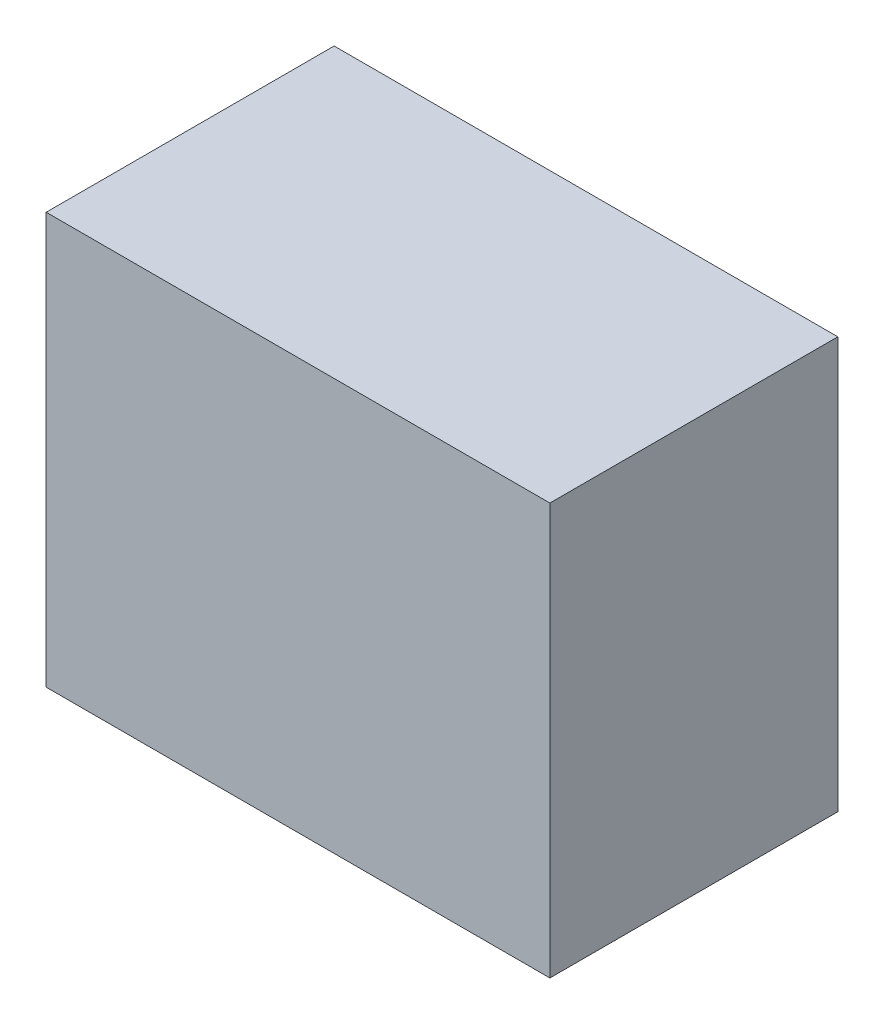
ISO-10303-21;
HEADER;
FILE_DESCRIPTION(('STEP AP214'),'2;1');
FILE_NAME('part.step','',(''),(''),'','','');
FILE_SCHEMA(('AUTOMOTIVE_DESIGN { 1 0 10303 214 1 1 1 1 }'));
ENDSEC;
DATA;
#1=APPLICATION_CONTEXT('core data for automotive mechanical design processes');
#2=APPLICATION_PROTOCOL_DEFINITION('international standard','automotive_design',2000,#1);
#3=PRODUCT_CONTEXT('',#1,'mechanical');
#4=PRODUCT('Part','Part','',(#3));
#5=PRODUCT_RELATED_PRODUCT_CATEGORY('part','',(#4));
#6=PRODUCT_DEFINITION_FORMATION('','',#4);
#7=PRODUCT_DEFINITION_CONTEXT('part definition',#1,'design');
#8=PRODUCT_DEFINITION('design','',#6,#7);
#9=PRODUCT_DEFINITION_SHAPE('','',#8);
#10=(LENGTH_UNIT() NAMED_UNIT(*) SI_UNIT(.MILLI.,.METRE.));
#11=(NAMED_UNIT(*) PLANE_ANGLE_UNIT() SI_UNIT($,.RADIAN.));
#12=(NAMED_UNIT(*) SI_UNIT($,.STERADIAN.) SOLID_ANGLE_UNIT());
#13=UNCERTAINTY_MEASURE_WITH_UNIT(LENGTH_MEASURE(1.E-05),#10,'distance_accuracy_value','');
#14=(GEOMETRIC_REPRESENTATION_CONTEXT(3) GLOBAL_UNCERTAINTY_ASSIGNED_CONTEXT((#13)) GLOBAL_UNIT_ASSIGNED_CONTEXT((#10,
#11,#12)) REPRESENTATION_CONTEXT('',''));
#15=CARTESIAN_POINT('',(0.,0.,0.));
#16=DIRECTION('',(0.,0.,1.));
#17=DIRECTION('',(1.,0.,0.));
#18=AXIS2_PLACEMENT_3D('',#15,#16,#17);
#19=CARTESIAN_POINT('',(0.,0.,0.));
#20=DIRECTION('',(1.,0.,0.));
#21=DIRECTION('',(0.,0.,1.));
#22=AXIS2_PLACEMENT_3D('',#19,#20,#21);
#23=PLANE('',#22);
#24=DIRECTION('',(0.,1.,0.));
#25=VECTOR('',#24,1.);
#26=CARTESIAN_POINT('',(0.,0.,0.343));
#27=LINE('',#26,#25);
#28=CARTESIAN_POINT('',(0.,0.,0.343));
#29=VERTEX_POINT('',#28);
#30=CARTESIAN_POINT('',(0.,0.49,0.343));
#31=VERTEX_POINT('',#30);
#32=EDGE_CURVE('E11',#29,#31,#27,.T.);
#33=ORIENTED_EDGE('',*,*,#32,.T.);
#34=DIRECTION('',(0.,0.,1.));
#35=VECTOR('',#34,1.);
#36=CARTESIAN_POINT('',(0.,0.49,0.));
#37=LINE('',#36,#35);
#38=CARTESIAN_POINT('',(0.,0.49,0.));
#39=VERTEX_POINT('',#38);
#40=EDGE_CURVE('E24',#39,#31,#37,.T.);
#41=ORIENTED_EDGE('',*,*,#40,.F.);
#42=DIRECTION('',(0.,1.,0.));
#43=VECTOR('',#42,1.);
#44=CARTESIAN_POINT('',(0.,0.,0.));
#45=LINE('',#44,#43);
#46=CARTESIAN_POINT('',(0.,0.,0.));
#47=VERTEX_POINT('',#46);
#48=EDGE_CURVE('E86',#47,#39,#45,.T.);
#49=ORIENTED_EDGE('',*,*,#48,.F.);
#50=DIRECTION('',(0.,0.,1.));
#51=VECTOR('',#50,1.);
#52=CARTESIAN_POINT('',(0.,0.,0.));
#53=LINE('',#52,#51);
#54=EDGE_CURVE('E36',#47,#29,#53,.T.);
#55=ORIENTED_EDGE('',*,*,#54,.T.);
#56=EDGE_LOOP('',(#33,#41,#49,#55));
#57=FACE_BOUND('',#56,.T.);
#58=ADVANCED_FACE('F17',(#57),#23,.F.);
#59=CARTESIAN_POINT('',(0.6,0.,0.));
#60=DIRECTION('',(1.,0.,0.));
#61=DIRECTION('',(0.,0.,1.));
#62=AXIS2_PLACEMENT_3D('',#59,#60,#61);
#63=PLANE('',#62);
#64=DIRECTION('',(0.,0.,1.));
#65=VECTOR('',#64,1.);
#66=CARTESIAN_POINT('',(0.6,0.,0.));
#67=LINE('',#66,#65);
#68=CARTESIAN_POINT('',(0.6,0.,0.));
#69=VERTEX_POINT('',#68);
#70=CARTESIAN_POINT('',(0.6,0.,0.343));
#71=VERTEX_POINT('',#70);
#72=EDGE_CURVE('E83',#69,#71,#67,.T.);
#73=ORIENTED_EDGE('',*,*,#72,.F.);
#74=DIRECTION('',(0.,1.,0.));
#75=VECTOR('',#74,1.);
#76=CARTESIAN_POINT('',(0.6,0.,0.));
#77=LINE('',#76,#75);
#78=CARTESIAN_POINT('',(0.6,0.49,0.));
#79=VERTEX_POINT('',#78);
#80=EDGE_CURVE('E63',#69,#79,#77,.T.);
#81=ORIENTED_EDGE('',*,*,#80,.T.);
#82=DIRECTION('',(0.,0.,1.));
#83=VECTOR('',#82,1.);
#84=CARTESIAN_POINT('',(0.6,0.49,0.));
#85=LINE('',#84,#83);
#86=CARTESIAN_POINT('',(0.6,0.49,0.343));
#87=VERTEX_POINT('',#86);
#88=EDGE_CURVE('E57',#79,#87,#85,.T.);
#89=ORIENTED_EDGE('',*,*,#88,.T.);
#90=DIRECTION('',(0.,1.,0.));
#91=VECTOR('',#90,1.);
#92=CARTESIAN_POINT('',(0.6,0.,0.343));
#93=LINE('',#92,#91);
#94=EDGE_CURVE('E60',#71,#87,#93,.T.);
#95=ORIENTED_EDGE('',*,*,#94,.F.);
#96=EDGE_LOOP('',(#73,#81,#89,#95));
#97=FACE_BOUND('',#96,.T.);
#98=ADVANCED_FACE('F59',(#97),#63,.T.);
#99=CARTESIAN_POINT('',(0.,0.,0.));
#100=DIRECTION('',(0.,1.,0.));
#101=DIRECTION('',(0.,0.,1.));
#102=AXIS2_PLACEMENT_3D('',#99,#100,#101);
#103=PLANE('',#102);
#104=ORIENTED_EDGE('',*,*,#72,.T.);
#105=DIRECTION('',(1.,0.,0.));
#106=VECTOR('',#105,1.);
#107=CARTESIAN_POINT('',(0.,0.,0.343));
#108=LINE('',#107,#106);
#109=EDGE_CURVE('E71',#29,#71,#108,.T.);
#110=ORIENTED_EDGE('',*,*,#109,.F.);
#111=ORIENTED_EDGE('',*,*,#54,.F.);
#112=DIRECTION('',(1.,0.,0.));
#113=VECTOR('',#112,1.);
#114=CARTESIAN_POINT('',(0.,0.,0.));
#115=LINE('',#114,#113);
#116=EDGE_CURVE('E76',#47,#69,#115,.T.);
#117=ORIENTED_EDGE('',*,*,#116,.T.);
#118=EDGE_LOOP('',(#104,#110,#111,#117));
#119=FACE_BOUND('',#118,.T.);
#120=ADVANCED_FACE('F91',(#119),#103,.F.);
#121=CARTESIAN_POINT('',(0.,0.49,0.));
#122=DIRECTION('',(0.,1.,0.));
#123=DIRECTION('',(0.,0.,1.));
#124=AXIS2_PLACEMENT_3D('',#121,#122,#123);
#125=PLANE('',#124);
#126=DIRECTION('',(1.,0.,0.));
#127=VECTOR('',#126,1.);
#128=CARTESIAN_POINT('',(0.,0.49,0.));
#129=LINE('',#128,#127);
#130=EDGE_CURVE('E74',#39,#79,#129,.T.);
#131=ORIENTED_EDGE('',*,*,#130,.F.);
#132=ORIENTED_EDGE('',*,*,#40,.T.);
#133=DIRECTION('',(1.,0.,0.));
#134=VECTOR('',#133,1.);
#135=CARTESIAN_POINT('',(0.,0.49,0.343));
#136=LINE('',#135,#134);
#137=EDGE_CURVE('E69',#31,#87,#136,.T.);
#138=ORIENTED_EDGE('',*,*,#137,.T.);
#139=ORIENTED_EDGE('',*,*,#88,.F.);
#140=EDGE_LOOP('',(#131,#132,#138,#139));
#141=FACE_BOUND('',#140,.T.);
#142=ADVANCED_FACE('F73',(#141),#125,.T.);
#143=CARTESIAN_POINT('',(0.,0.,0.));
#144=DIRECTION('',(0.,0.,1.));
#145=DIRECTION('',(1.,0.,0.));
#146=AXIS2_PLACEMENT_3D('',#143,#144,#145);
#147=PLANE('',#146);
#148=ORIENTED_EDGE('',*,*,#130,.T.);
#149=ORIENTED_EDGE('',*,*,#80,.F.);
#150=ORIENTED_EDGE('',*,*,#116,.F.);
#151=ORIENTED_EDGE('',*,*,#48,.T.);
#152=EDGE_LOOP('',(#148,#149,#150,#151));
#153=FACE_BOUND('',#152,.T.);
#154=ADVANCED_FACE('F89',(#153),#147,.F.);
#155=CARTESIAN_POINT('',(0.,0.,0.343));
#156=DIRECTION('',(0.,0.,1.));
#157=DIRECTION('',(1.,0.,0.));
#158=AXIS2_PLACEMENT_3D('',#155,#156,#157);
#159=PLANE('',#158);
#160=ORIENTED_EDGE('',*,*,#32,.F.);
#161=ORIENTED_EDGE('',*,*,#109,.T.);
#162=ORIENTED_EDGE('',*,*,#94,.T.);
#163=ORIENTED_EDGE('',*,*,#137,.F.);
#164=EDGE_LOOP('',(#160,#161,#162,#163));
#165=FACE_BOUND('',#164,.T.);
#166=ADVANCED_FACE('F68',(#165),#159,.T.);
#167=CLOSED_SHELL('',(#58,#98,#120,#142,#154,#166));
#168=MANIFOLD_SOLID_BREP('B1',#167);
#169=ADVANCED_BREP_SHAPE_REPRESENTATION('',(#18,#168),#14);
#170=SHAPE_DEFINITION_REPRESENTATION(#9,#169);
ENDSEC;
END-ISO-10303-21;
